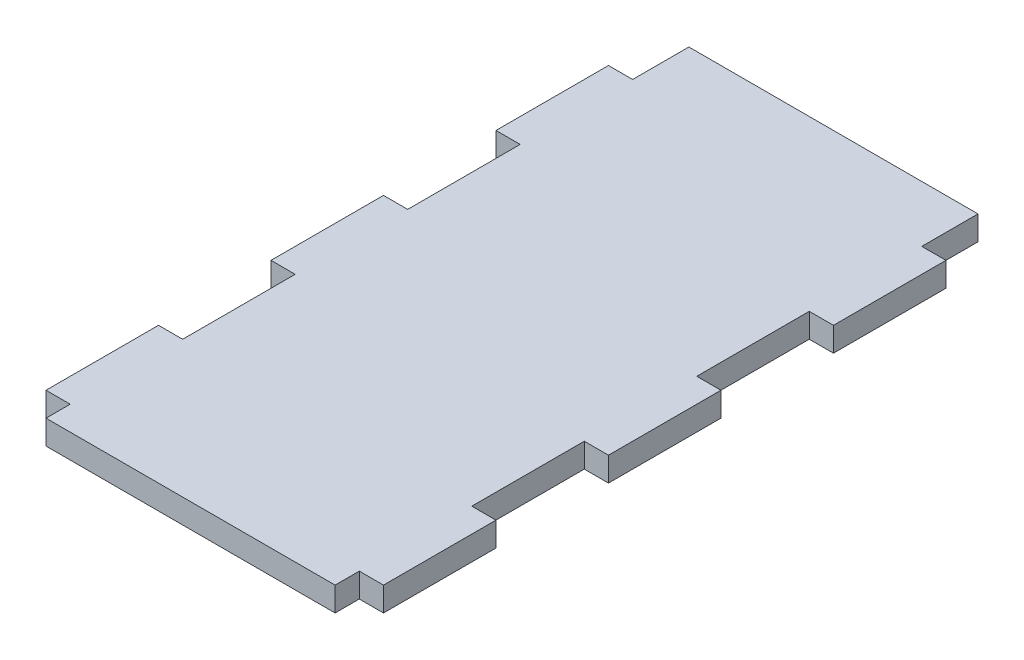
ISO-10303-21;
HEADER;
FILE_DESCRIPTION(('STEP AP214'),'2;1');
FILE_NAME('part.step','',(''),(''),'','','');
FILE_SCHEMA(('AUTOMOTIVE_DESIGN { 1 0 10303 214 1 1 1 1 }'));
ENDSEC;
DATA;
#1=APPLICATION_CONTEXT('core data for automotive mechanical design processes');
#2=APPLICATION_PROTOCOL_DEFINITION('international standard','automotive_design',2000,#1);
#3=PRODUCT_CONTEXT('',#1,'mechanical');
#4=PRODUCT('Part','Part','',(#3));
#5=PRODUCT_RELATED_PRODUCT_CATEGORY('part','',(#4));
#6=PRODUCT_DEFINITION_FORMATION('','',#4);
#7=PRODUCT_DEFINITION_CONTEXT('part definition',#1,'design');
#8=PRODUCT_DEFINITION('design','',#6,#7);
#9=PRODUCT_DEFINITION_SHAPE('','',#8);
#10=(LENGTH_UNIT() NAMED_UNIT(*) SI_UNIT(.MILLI.,.METRE.));
#11=(NAMED_UNIT(*) PLANE_ANGLE_UNIT() SI_UNIT($,.RADIAN.));
#12=(NAMED_UNIT(*) SI_UNIT($,.STERADIAN.) SOLID_ANGLE_UNIT());
#13=UNCERTAINTY_MEASURE_WITH_UNIT(LENGTH_MEASURE(1.E-05),#10,'distance_accuracy_value','');
#14=(GEOMETRIC_REPRESENTATION_CONTEXT(3) GLOBAL_UNCERTAINTY_ASSIGNED_CONTEXT((#13)) GLOBAL_UNIT_ASSIGNED_CONTEXT((#10,
#11,#12)) REPRESENTATION_CONTEXT('',''));
#15=CARTESIAN_POINT('',(0.,0.,0.));
#16=DIRECTION('',(0.,0.,1.));
#17=DIRECTION('',(1.,0.,0.));
#18=AXIS2_PLACEMENT_3D('',#15,#16,#17);
#19=CARTESIAN_POINT('',(38.1,5.461,-63.5));
#20=DIRECTION('',(0.,0.,1.));
#21=DIRECTION('',(1.,0.,0.));
#22=AXIS2_PLACEMENT_3D('',#19,#20,#21);
#23=PLANE('',#22);
#24=DIRECTION('',(0.,-1.,0.));
#25=VECTOR('',#24,1.);
#26=CARTESIAN_POINT('',(32.639,5.461,-63.5));
#27=LINE('',#26,#25);
#28=CARTESIAN_POINT('',(32.639,5.461,-63.5));
#29=VERTEX_POINT('',#28);
#30=CARTESIAN_POINT('',(32.639,0.,-63.5));
#31=VERTEX_POINT('',#30);
#32=EDGE_CURVE('E245',#29,#31,#27,.T.);
#33=ORIENTED_EDGE('',*,*,#32,.F.);
#34=DIRECTION('',(-1.,0.,0.));
#35=VECTOR('',#34,1.);
#36=CARTESIAN_POINT('',(38.1,5.461,-63.5));
#37=LINE('',#36,#35);
#38=CARTESIAN_POINT('',(38.1,5.461,-63.5));
#39=VERTEX_POINT('',#38);
#40=EDGE_CURVE('E389',#39,#29,#37,.T.);
#41=ORIENTED_EDGE('',*,*,#40,.F.);
#42=DIRECTION('',(0.,-1.,0.));
#43=VECTOR('',#42,1.);
#44=CARTESIAN_POINT('',(38.1,5.461,-63.5));
#45=LINE('',#44,#43);
#46=CARTESIAN_POINT('',(38.1,0.,-63.5));
#47=VERTEX_POINT('',#46);
#48=EDGE_CURVE('E410',#39,#47,#45,.T.);
#49=ORIENTED_EDGE('',*,*,#48,.T.);
#50=DIRECTION('',(-1.,0.,0.));
#51=VECTOR('',#50,1.);
#52=CARTESIAN_POINT('',(38.1,0.,-63.5));
#53=LINE('',#52,#51);
#54=EDGE_CURVE('E60',#47,#31,#53,.T.);
#55=ORIENTED_EDGE('',*,*,#54,.T.);
#56=EDGE_LOOP('',(#33,#41,#49,#55));
#57=FACE_BOUND('',#56,.T.);
#58=ADVANCED_FACE('F37',(#57),#23,.F.);
#59=DIRECTION('',(0.,1.,0.));
#60=VECTOR('',#59,1.);
#61=CARTESIAN_POINT('',(-32.639,5.46100000000001,-63.5));
#62=LINE('',#61,#60);
#63=CARTESIAN_POINT('',(-32.639,0.,-63.5));
#64=VERTEX_POINT('',#63);
#65=CARTESIAN_POINT('',(-32.639,5.46100000000001,-63.5));
#66=VERTEX_POINT('',#65);
#67=EDGE_CURVE('E52',#64,#66,#62,.T.);
#68=ORIENTED_EDGE('',*,*,#67,.F.);
#69=CARTESIAN_POINT('',(-38.1,0.,-63.5));
#70=VERTEX_POINT('',#69);
#71=EDGE_CURVE('E405',#64,#70,#53,.T.);
#72=ORIENTED_EDGE('',*,*,#71,.T.);
#73=DIRECTION('',(0.,-1.,0.));
#74=VECTOR('',#73,1.);
#75=CARTESIAN_POINT('',(-38.1,5.461,-63.5));
#76=LINE('',#75,#74);
#77=CARTESIAN_POINT('',(-38.1,5.461,-63.5));
#78=VERTEX_POINT('',#77);
#79=EDGE_CURVE('E392',#78,#70,#76,.T.);
#80=ORIENTED_EDGE('',*,*,#79,.F.);
#81=EDGE_CURVE('E387',#66,#78,#37,.T.);
#82=ORIENTED_EDGE('',*,*,#81,.F.);
#83=EDGE_LOOP('',(#68,#72,#80,#82));
#84=FACE_BOUND('',#83,.T.);
#85=ADVANCED_FACE('F489',(#84),#23,.F.);
#86=CARTESIAN_POINT('',(38.1,5.461,63.5));
#87=DIRECTION('',(0.,0.,-1.));
#88=DIRECTION('',(-1.,0.,0.));
#89=AXIS2_PLACEMENT_3D('',#86,#87,#88);
#90=PLANE('',#89);
#91=DIRECTION('',(0.,-1.,0.));
#92=VECTOR('',#91,1.);
#93=CARTESIAN_POINT('',(-32.639,5.461,63.5));
#94=LINE('',#93,#92);
#95=CARTESIAN_POINT('',(-32.639,5.461,63.5));
#96=VERTEX_POINT('',#95);
#97=CARTESIAN_POINT('',(-32.639,0.,63.5));
#98=VERTEX_POINT('',#97);
#99=EDGE_CURVE('E246',#96,#98,#94,.T.);
#100=ORIENTED_EDGE('',*,*,#99,.F.);
#101=DIRECTION('',(1.,0.,0.));
#102=VECTOR('',#101,1.);
#103=CARTESIAN_POINT('',(38.1,5.461,63.5));
#104=LINE('',#103,#102);
#105=CARTESIAN_POINT('',(-38.1,5.461,63.5));
#106=VERTEX_POINT('',#105);
#107=EDGE_CURVE('E380',#106,#96,#104,.T.);
#108=ORIENTED_EDGE('',*,*,#107,.F.);
#109=DIRECTION('',(0.,-1.,0.));
#110=VECTOR('',#109,1.);
#111=CARTESIAN_POINT('',(-38.1,5.461,63.5));
#112=LINE('',#111,#110);
#113=CARTESIAN_POINT('',(-38.1,0.,63.5));
#114=VERTEX_POINT('',#113);
#115=EDGE_CURVE('E11',#106,#114,#112,.T.);
#116=ORIENTED_EDGE('',*,*,#115,.T.);
#117=DIRECTION('',(1.,0.,0.));
#118=VECTOR('',#117,1.);
#119=CARTESIAN_POINT('',(38.1,0.,63.5));
#120=LINE('',#119,#118);
#121=EDGE_CURVE('E399',#114,#98,#120,.T.);
#122=ORIENTED_EDGE('',*,*,#121,.T.);
#123=EDGE_LOOP('',(#100,#108,#116,#122));
#124=FACE_BOUND('',#123,.T.);
#125=ADVANCED_FACE('F452',(#124),#90,.F.);
#126=DIRECTION('',(0.,1.,0.));
#127=VECTOR('',#126,1.);
#128=CARTESIAN_POINT('',(32.639,5.46100000000001,63.5));
#129=LINE('',#128,#127);
#130=CARTESIAN_POINT('',(32.639,0.,63.5));
#131=VERTEX_POINT('',#130);
#132=CARTESIAN_POINT('',(32.639,5.46100000000001,63.5));
#133=VERTEX_POINT('',#132);
#134=EDGE_CURVE('E249',#131,#133,#129,.T.);
#135=ORIENTED_EDGE('',*,*,#134,.F.);
#136=CARTESIAN_POINT('',(38.1,0.,63.5));
#137=VERTEX_POINT('',#136);
#138=EDGE_CURVE('E396',#131,#137,#120,.T.);
#139=ORIENTED_EDGE('',*,*,#138,.T.);
#140=DIRECTION('',(0.,-1.,0.));
#141=VECTOR('',#140,1.);
#142=CARTESIAN_POINT('',(38.1,5.461,63.5));
#143=LINE('',#142,#141);
#144=CARTESIAN_POINT('',(38.1,5.461,63.5));
#145=VERTEX_POINT('',#144);
#146=EDGE_CURVE('E45',#145,#137,#143,.T.);
#147=ORIENTED_EDGE('',*,*,#146,.F.);
#148=EDGE_CURVE('E377',#133,#145,#104,.T.);
#149=ORIENTED_EDGE('',*,*,#148,.F.);
#150=EDGE_LOOP('',(#135,#139,#147,#149));
#151=FACE_BOUND('',#150,.T.);
#152=ADVANCED_FACE('F438',(#151),#90,.F.);
#153=CARTESIAN_POINT('',(-38.1,5.461,63.5));
#154=DIRECTION('',(1.,0.,0.));
#155=DIRECTION('',(0.,0.,-1.));
#156=AXIS2_PLACEMENT_3D('',#153,#154,#155);
#157=PLANE('',#156);
#158=DIRECTION('',(0.,0.,1.));
#159=VECTOR('',#158,1.);
#160=CARTESIAN_POINT('',(-38.1,0.,63.5));
#161=LINE('',#160,#159);
#162=CARTESIAN_POINT('',(-38.100000000001,0.,-38.0999999999997));
#163=VERTEX_POINT('',#162);
#164=EDGE_CURVE('E393',#70,#163,#161,.T.);
#165=ORIENTED_EDGE('',*,*,#164,.T.);
#166=DIRECTION('',(0.,1.,0.));
#167=VECTOR('',#166,1.);
#168=CARTESIAN_POINT('',(-38.100000000001,0.,-38.0999999999997));
#169=LINE('',#168,#167);
#170=CARTESIAN_POINT('',(-38.100000000001,5.46099999999997,-38.0999999999998));
#171=VERTEX_POINT('',#170);
#172=EDGE_CURVE('E295',#163,#171,#169,.T.);
#173=ORIENTED_EDGE('',*,*,#172,.T.);
#174=DIRECTION('',(0.,0.,1.));
#175=VECTOR('',#174,1.);
#176=CARTESIAN_POINT('',(-38.1,5.461,63.5));
#177=LINE('',#176,#175);
#178=EDGE_CURVE('E374',#78,#171,#177,.T.);
#179=ORIENTED_EDGE('',*,*,#178,.F.);
#180=ORIENTED_EDGE('',*,*,#79,.T.);
#181=EDGE_LOOP('',(#165,#173,#179,#180));
#182=FACE_BOUND('',#181,.T.);
#183=ADVANCED_FACE('F486',(#182),#157,.F.);
#184=CARTESIAN_POINT('',(-38.1000000000009,5.46099999999996,-12.6999999999998));
#185=VERTEX_POINT('',#184);
#186=CARTESIAN_POINT('',(-38.1000000000008,5.46099999999996,12.7000000000002));
#187=VERTEX_POINT('',#186);
#188=EDGE_CURVE('E378',#185,#187,#177,.T.);
#189=ORIENTED_EDGE('',*,*,#188,.F.);
#190=DIRECTION('',(0.,-1.,0.));
#191=VECTOR('',#190,1.);
#192=CARTESIAN_POINT('',(-38.1000000000009,0.,-12.6999999999997));
#193=LINE('',#192,#191);
#194=CARTESIAN_POINT('',(-38.1000000000009,0.,-12.6999999999997));
#195=VERTEX_POINT('',#194);
#196=EDGE_CURVE('E283',#185,#195,#193,.T.);
#197=ORIENTED_EDGE('',*,*,#196,.T.);
#198=CARTESIAN_POINT('',(-38.1000000000008,0.,12.7000000000002));
#199=VERTEX_POINT('',#198);
#200=EDGE_CURVE('E397',#195,#199,#161,.T.);
#201=ORIENTED_EDGE('',*,*,#200,.T.);
#202=DIRECTION('',(0.,1.,0.));
#203=VECTOR('',#202,1.);
#204=CARTESIAN_POINT('',(-38.1000000000008,0.,12.7000000000002));
#205=LINE('',#204,#203);
#206=EDGE_CURVE('E286',#199,#187,#205,.T.);
#207=ORIENTED_EDGE('',*,*,#206,.T.);
#208=EDGE_LOOP('',(#189,#197,#201,#207));
#209=FACE_BOUND('',#208,.T.);
#210=ADVANCED_FACE('F462',(#209),#157,.F.);
#211=CARTESIAN_POINT('',(38.1,5.461,63.5));
#212=DIRECTION('',(-1.,0.,0.));
#213=DIRECTION('',(0.,0.,1.));
#214=AXIS2_PLACEMENT_3D('',#211,#212,#213);
#215=PLANE('',#214);
#216=DIRECTION('',(0.,-1.,0.));
#217=VECTOR('',#216,1.);
#218=CARTESIAN_POINT('',(38.0999999999997,1.66533453693773E-13,38.1));
#219=LINE('',#218,#217);
#220=CARTESIAN_POINT('',(38.0999999999996,5.46100000000015,38.1));
#221=VERTEX_POINT('',#220);
#222=CARTESIAN_POINT('',(38.0999999999997,1.66533453693773E-13,38.1));
#223=VERTEX_POINT('',#222);
#224=EDGE_CURVE('E357',#221,#223,#219,.T.);
#225=ORIENTED_EDGE('',*,*,#224,.F.);
#226=DIRECTION('',(0.,0.,-1.));
#227=VECTOR('',#226,1.);
#228=CARTESIAN_POINT('',(38.1,5.461,63.5));
#229=LINE('',#228,#227);
#230=EDGE_CURVE('E384',#145,#221,#229,.T.);
#231=ORIENTED_EDGE('',*,*,#230,.F.);
#232=ORIENTED_EDGE('',*,*,#146,.T.);
#233=DIRECTION('',(0.,0.,-1.));
#234=VECTOR('',#233,1.);
#235=CARTESIAN_POINT('',(38.1,0.,63.5));
#236=LINE('',#235,#234);
#237=EDGE_CURVE('E402',#137,#223,#236,.T.);
#238=ORIENTED_EDGE('',*,*,#237,.T.);
#239=EDGE_LOOP('',(#225,#231,#232,#238));
#240=FACE_BOUND('',#239,.T.);
#241=ADVANCED_FACE('F417',(#240),#215,.F.);
#242=DIRECTION('',(0.,1.,0.));
#243=VECTOR('',#242,1.);
#244=CARTESIAN_POINT('',(38.0999999999997,1.80411241501588E-13,12.7));
#245=LINE('',#244,#243);
#246=CARTESIAN_POINT('',(38.0999999999997,1.80411241501588E-13,12.7));
#247=VERTEX_POINT('',#246);
#248=CARTESIAN_POINT('',(38.0999999999996,5.46100000000014,12.7));
#249=VERTEX_POINT('',#248);
#250=EDGE_CURVE('E325',#247,#249,#245,.T.);
#251=ORIENTED_EDGE('',*,*,#250,.F.);
#252=CARTESIAN_POINT('',(38.0999999999997,2.08166817117217E-13,-12.6999999999999));
#253=VERTEX_POINT('',#252);
#254=EDGE_CURVE('E406',#247,#253,#236,.T.);
#255=ORIENTED_EDGE('',*,*,#254,.T.);
#256=DIRECTION('',(0.,-1.,0.));
#257=VECTOR('',#256,1.);
#258=CARTESIAN_POINT('',(38.0999999999997,2.08166817117217E-13,-12.6999999999999));
#259=LINE('',#258,#257);
#260=CARTESIAN_POINT('',(38.0999999999996,5.46100000000014,-12.6999999999999));
#261=VERTEX_POINT('',#260);
#262=EDGE_CURVE('E327',#261,#253,#259,.T.);
#263=ORIENTED_EDGE('',*,*,#262,.F.);
#264=EDGE_CURVE('E388',#249,#261,#229,.T.);
#265=ORIENTED_EDGE('',*,*,#264,.F.);
#266=EDGE_LOOP('',(#251,#255,#263,#265));
#267=FACE_BOUND('',#266,.T.);
#268=ADVANCED_FACE('F513',(#267),#215,.F.);
#269=DIRECTION('',(0.,1.,0.));
#270=VECTOR('',#269,1.);
#271=CARTESIAN_POINT('',(38.0999999999997,2.15105711021124E-13,-38.0999999999999));
#272=LINE('',#271,#270);
#273=CARTESIAN_POINT('',(38.0999999999997,2.15105711021124E-13,-38.0999999999999));
#274=VERTEX_POINT('',#273);
#275=CARTESIAN_POINT('',(38.0999999999996,5.46100000000015,-38.1));
#276=VERTEX_POINT('',#275);
#277=EDGE_CURVE('E347',#274,#276,#272,.T.);
#278=ORIENTED_EDGE('',*,*,#277,.F.);
#279=EDGE_CURVE('E401',#274,#47,#236,.T.);
#280=ORIENTED_EDGE('',*,*,#279,.T.);
#281=ORIENTED_EDGE('',*,*,#48,.F.);
#282=EDGE_CURVE('E383',#276,#39,#229,.T.);
#283=ORIENTED_EDGE('',*,*,#282,.F.);
#284=EDGE_LOOP('',(#278,#280,#281,#283));
#285=FACE_BOUND('',#284,.T.);
#286=ADVANCED_FACE('F522',(#285),#215,.F.);
#287=CARTESIAN_POINT('',(0.,0.,0.));
#288=DIRECTION('',(0.,1.,0.));
#289=DIRECTION('',(0.,0.,1.));
#290=AXIS2_PLACEMENT_3D('',#287,#288,#289);
#291=PLANE('',#290);
#292=DIRECTION('',(0.,0.,-1.));
#293=VECTOR('',#292,1.);
#294=CARTESIAN_POINT('',(-32.6390000000004,0.,82.9351920908021));
#295=LINE('',#294,#293);
#296=CARTESIAN_POINT('',(-32.6390000000009,0.,-12.6999999999998));
#297=VERTEX_POINT('',#296);
#298=CARTESIAN_POINT('',(-32.639000000001,0.,-38.0999999999998));
#299=VERTEX_POINT('',#298);
#300=EDGE_CURVE('E311',#297,#299,#295,.T.);
#301=ORIENTED_EDGE('',*,*,#300,.T.);
#302=DIRECTION('',(-1.,0.,0.));
#303=VECTOR('',#302,1.);
#304=CARTESIAN_POINT('',(-32.639000000001,0.,-38.0999999999998));
#305=LINE('',#304,#303);
#306=EDGE_CURVE('E308',#299,#163,#305,.T.);
#307=ORIENTED_EDGE('',*,*,#306,.T.);
#308=ORIENTED_EDGE('',*,*,#164,.F.);
#309=ORIENTED_EDGE('',*,*,#71,.F.);
#310=DIRECTION('',(0.,0.,1.));
#311=VECTOR('',#310,1.);
#312=CARTESIAN_POINT('',(-32.639,0.,-76.2));
#313=LINE('',#312,#311);
#314=CARTESIAN_POINT('',(-32.639,0.,-76.2));
#315=VERTEX_POINT('',#314);
#316=EDGE_CURVE('E230',#315,#64,#313,.T.);
#317=ORIENTED_EDGE('',*,*,#316,.F.);
#318=DIRECTION('',(-1.,0.,0.));
#319=VECTOR('',#318,1.);
#320=CARTESIAN_POINT('',(32.639,0.,-76.2));
#321=LINE('',#320,#319);
#322=CARTESIAN_POINT('',(32.639,0.,-76.2));
#323=VERTEX_POINT('',#322);
#324=EDGE_CURVE('E222',#323,#315,#321,.T.);
#325=ORIENTED_EDGE('',*,*,#324,.F.);
#326=DIRECTION('',(0.,0.,1.));
#327=VECTOR('',#326,1.);
#328=CARTESIAN_POINT('',(32.639,0.,-76.2));
#329=LINE('',#328,#327);
#330=EDGE_CURVE('E227',#323,#31,#329,.T.);
#331=ORIENTED_EDGE('',*,*,#330,.T.);
#332=ORIENTED_EDGE('',*,*,#54,.F.);
#333=ORIENTED_EDGE('',*,*,#279,.F.);
#334=DIRECTION('',(-1.,0.,0.));
#335=VECTOR('',#334,1.);
#336=CARTESIAN_POINT('',(38.0999999999997,2.15105711021124E-13,-38.0999999999999));
#337=LINE('',#336,#335);
#338=CARTESIAN_POINT('',(32.6389999999997,1.89084858881472E-13,-38.0999999999999));
#339=VERTEX_POINT('',#338);
#340=EDGE_CURVE('E352',#274,#339,#337,.T.);
#341=ORIENTED_EDGE('',*,*,#340,.T.);
#342=DIRECTION('',(0.,0.,-1.));
#343=VECTOR('',#342,1.);
#344=CARTESIAN_POINT('',(32.6389999999997,1.28369537222284E-13,82.9351920908019));
#345=LINE('',#344,#343);
#346=CARTESIAN_POINT('',(32.6389999999997,0.,-12.6999999999999));
#347=VERTEX_POINT('',#346);
#348=EDGE_CURVE('E355',#347,#339,#345,.T.);
#349=ORIENTED_EDGE('',*,*,#348,.F.);
#350=DIRECTION('',(-1.,0.,0.));
#351=VECTOR('',#350,1.);
#352=CARTESIAN_POINT('',(38.0999999999997,2.08166817117217E-13,-12.6999999999999));
#353=LINE('',#352,#351);
#354=EDGE_CURVE('E341',#253,#347,#353,.T.);
#355=ORIENTED_EDGE('',*,*,#354,.F.);
#356=ORIENTED_EDGE('',*,*,#254,.F.);
#357=DIRECTION('',(-1.,0.,0.));
#358=VECTOR('',#357,1.);
#359=CARTESIAN_POINT('',(38.0999999999997,1.80411241501588E-13,12.7));
#360=LINE('',#359,#358);
#361=CARTESIAN_POINT('',(32.6389999999997,1.54390389361936E-13,12.7));
#362=VERTEX_POINT('',#361);
#363=EDGE_CURVE('E337',#247,#362,#360,.T.);
#364=ORIENTED_EDGE('',*,*,#363,.T.);
#365=CARTESIAN_POINT('',(32.6389999999997,0.,38.1));
#366=VERTEX_POINT('',#365);
#367=EDGE_CURVE('E319',#366,#362,#345,.T.);
#368=ORIENTED_EDGE('',*,*,#367,.F.);
#369=DIRECTION('',(-1.,0.,0.));
#370=VECTOR('',#369,1.);
#371=CARTESIAN_POINT('',(38.0999999999997,1.66533453693773E-13,38.1));
#372=LINE('',#371,#370);
#373=EDGE_CURVE('E334',#223,#366,#372,.T.);
#374=ORIENTED_EDGE('',*,*,#373,.F.);
#375=ORIENTED_EDGE('',*,*,#237,.F.);
#376=ORIENTED_EDGE('',*,*,#138,.F.);
#377=DIRECTION('',(0.,0.,-1.));
#378=VECTOR('',#377,1.);
#379=CARTESIAN_POINT('',(32.639,0.,68.961));
#380=LINE('',#379,#378);
#381=CARTESIAN_POINT('',(32.639,0.,68.961));
#382=VERTEX_POINT('',#381);
#383=EDGE_CURVE('E272',#382,#131,#380,.T.);
#384=ORIENTED_EDGE('',*,*,#383,.F.);
#385=DIRECTION('',(1.,0.,0.));
#386=VECTOR('',#385,1.);
#387=CARTESIAN_POINT('',(-32.639,0.,68.961));
#388=LINE('',#387,#386);
#389=CARTESIAN_POINT('',(-32.639,0.,68.961));
#390=VERTEX_POINT('',#389);
#391=EDGE_CURVE('E258',#390,#382,#388,.T.);
#392=ORIENTED_EDGE('',*,*,#391,.F.);
#393=DIRECTION('',(0.,0.,-1.));
#394=VECTOR('',#393,1.);
#395=CARTESIAN_POINT('',(-32.639,0.,68.961));
#396=LINE('',#395,#394);
#397=EDGE_CURVE('E275',#390,#98,#396,.T.);
#398=ORIENTED_EDGE('',*,*,#397,.T.);
#399=ORIENTED_EDGE('',*,*,#121,.F.);
#400=CARTESIAN_POINT('',(-38.1000000000006,0.,38.1000000000002));
#401=VERTEX_POINT('',#400);
#402=EDGE_CURVE('E398',#401,#114,#161,.T.);
#403=ORIENTED_EDGE('',*,*,#402,.F.);
#404=DIRECTION('',(-1.,0.,0.));
#405=VECTOR('',#404,1.);
#406=CARTESIAN_POINT('',(-32.6390000000006,0.,38.1000000000002));
#407=LINE('',#406,#405);
#408=CARTESIAN_POINT('',(-32.6390000000006,0.,38.1000000000002));
#409=VERTEX_POINT('',#408);
#410=EDGE_CURVE('E289',#409,#401,#407,.T.);
#411=ORIENTED_EDGE('',*,*,#410,.F.);
#412=CARTESIAN_POINT('',(-32.6390000000008,0.,12.7000000000002));
#413=VERTEX_POINT('',#412);
#414=EDGE_CURVE('E324',#409,#413,#295,.T.);
#415=ORIENTED_EDGE('',*,*,#414,.T.);
#416=DIRECTION('',(-1.,0.,0.));
#417=VECTOR('',#416,1.);
#418=CARTESIAN_POINT('',(-32.6390000000008,0.,12.7000000000002));
#419=LINE('',#418,#417);
#420=EDGE_CURVE('E292',#413,#199,#419,.T.);
#421=ORIENTED_EDGE('',*,*,#420,.T.);
#422=ORIENTED_EDGE('',*,*,#200,.F.);
#423=DIRECTION('',(-1.,0.,0.));
#424=VECTOR('',#423,1.);
#425=CARTESIAN_POINT('',(-32.6390000000009,0.,-12.6999999999998));
#426=LINE('',#425,#424);
#427=EDGE_CURVE('E296',#297,#195,#426,.T.);
#428=ORIENTED_EDGE('',*,*,#427,.F.);
#429=EDGE_LOOP('',(#301,#307,#308,#309,#317,#325,#331,#332,#333,#341,#349,#355,#356,#364,#368,
#374,#375,#376,#384,#392,#398,#399,#403,#411,#415,#421,#422,#428));
#430=FACE_BOUND('',#429,.T.);
#431=ADVANCED_FACE('F225',(#430),#291,.F.);
#432=CARTESIAN_POINT('',(-38.1000000000006,5.46099999999997,38.1000000000002));
#433=VERTEX_POINT('',#432);
#434=EDGE_CURVE('E379',#433,#106,#177,.T.);
#435=ORIENTED_EDGE('',*,*,#434,.F.);
#436=DIRECTION('',(0.,-1.,0.));
#437=VECTOR('',#436,1.);
#438=CARTESIAN_POINT('',(-38.1000000000006,0.,38.1000000000002));
#439=LINE('',#438,#437);
#440=EDGE_CURVE('E316',#433,#401,#439,.T.);
#441=ORIENTED_EDGE('',*,*,#440,.T.);
#442=ORIENTED_EDGE('',*,*,#402,.T.);
#443=ORIENTED_EDGE('',*,*,#115,.F.);
#444=EDGE_LOOP('',(#435,#441,#442,#443));
#445=FACE_BOUND('',#444,.T.);
#446=ADVANCED_FACE('F39',(#445),#157,.F.);
#447=CARTESIAN_POINT('',(0.,5.461,0.));
#448=DIRECTION('',(0.,1.,0.));
#449=DIRECTION('',(0.,0.,1.));
#450=AXIS2_PLACEMENT_3D('',#447,#448,#449);
#451=PLANE('',#450);
#452=DIRECTION('',(-1.,0.,0.));
#453=VECTOR('',#452,1.);
#454=CARTESIAN_POINT('',(-32.639000000001,5.46099999999997,-38.0999999999998));
#455=LINE('',#454,#453);
#456=CARTESIAN_POINT('',(-32.639000000001,5.46099999999997,-38.0999999999998));
#457=VERTEX_POINT('',#456);
#458=EDGE_CURVE('E305',#457,#171,#455,.T.);
#459=ORIENTED_EDGE('',*,*,#458,.F.);
#460=DIRECTION('',(0.,0.,1.));
#461=VECTOR('',#460,1.);
#462=CARTESIAN_POINT('',(-32.6390000000008,5.461,1.64696710789036E-13));
#463=LINE('',#462,#461);
#464=CARTESIAN_POINT('',(-32.6390000000009,5.46099999999996,-12.6999999999998));
#465=VERTEX_POINT('',#464);
#466=EDGE_CURVE('E373',#457,#465,#463,.T.);
#467=ORIENTED_EDGE('',*,*,#466,.T.);
#468=DIRECTION('',(-1.,0.,0.));
#469=VECTOR('',#468,1.);
#470=CARTESIAN_POINT('',(-32.6390000000009,5.46099999999996,-12.6999999999998));
#471=LINE('',#470,#469);
#472=EDGE_CURVE('E298',#465,#185,#471,.T.);
#473=ORIENTED_EDGE('',*,*,#472,.T.);
#474=ORIENTED_EDGE('',*,*,#188,.T.);
#475=DIRECTION('',(-1.,0.,0.));
#476=VECTOR('',#475,1.);
#477=CARTESIAN_POINT('',(-32.6390000000008,5.46099999999996,12.7000000000002));
#478=LINE('',#477,#476);
#479=CARTESIAN_POINT('',(-32.6390000000008,5.46099999999996,12.7000000000002));
#480=VERTEX_POINT('',#479);
#481=EDGE_CURVE('E285',#480,#187,#478,.T.);
#482=ORIENTED_EDGE('',*,*,#481,.F.);
#483=CARTESIAN_POINT('',(-32.6390000000006,5.46099999999997,38.1000000000002));
#484=VERTEX_POINT('',#483);
#485=EDGE_CURVE('E370',#480,#484,#463,.T.);
#486=ORIENTED_EDGE('',*,*,#485,.T.);
#487=DIRECTION('',(-1.,0.,0.));
#488=VECTOR('',#487,1.);
#489=CARTESIAN_POINT('',(-32.6390000000006,5.46099999999997,38.1000000000002));
#490=LINE('',#489,#488);
#491=EDGE_CURVE('E315',#484,#433,#490,.T.);
#492=ORIENTED_EDGE('',*,*,#491,.T.);
#493=ORIENTED_EDGE('',*,*,#434,.T.);
#494=ORIENTED_EDGE('',*,*,#107,.T.);
#495=DIRECTION('',(0.,0.,-1.));
#496=VECTOR('',#495,1.);
#497=CARTESIAN_POINT('',(-32.639,5.461,68.961));
#498=LINE('',#497,#496);
#499=CARTESIAN_POINT('',(-32.639,5.461,68.961));
#500=VERTEX_POINT('',#499);
#501=EDGE_CURVE('E263',#500,#96,#498,.T.);
#502=ORIENTED_EDGE('',*,*,#501,.F.);
#503=DIRECTION('',(-1.,0.,0.));
#504=VECTOR('',#503,1.);
#505=CARTESIAN_POINT('',(-32.639,5.461,68.961));
#506=LINE('',#505,#504);
#507=CARTESIAN_POINT('',(32.639,5.46100000000001,68.961));
#508=VERTEX_POINT('',#507);
#509=EDGE_CURVE('E262',#508,#500,#506,.T.);
#510=ORIENTED_EDGE('',*,*,#509,.F.);
#511=DIRECTION('',(0.,0.,-1.));
#512=VECTOR('',#511,1.);
#513=CARTESIAN_POINT('',(32.639,5.46100000000001,68.961));
#514=LINE('',#513,#512);
#515=EDGE_CURVE('E269',#508,#133,#514,.T.);
#516=ORIENTED_EDGE('',*,*,#515,.T.);
#517=ORIENTED_EDGE('',*,*,#148,.T.);
#518=ORIENTED_EDGE('',*,*,#230,.T.);
#519=DIRECTION('',(-1.,0.,0.));
#520=VECTOR('',#519,1.);
#521=CARTESIAN_POINT('',(38.0999999999996,5.46100000000015,38.1));
#522=LINE('',#521,#520);
#523=CARTESIAN_POINT('',(32.6389999999996,5.46100000000012,38.1));
#524=VERTEX_POINT('',#523);
#525=EDGE_CURVE('E359',#221,#524,#522,.T.);
#526=ORIENTED_EDGE('',*,*,#525,.T.);
#527=DIRECTION('',(0.,0.,1.));
#528=VECTOR('',#527,1.);
#529=CARTESIAN_POINT('',(32.6389999999996,5.461,0.));
#530=LINE('',#529,#528);
#531=CARTESIAN_POINT('',(32.6389999999996,5.46100000000011,12.7));
#532=VERTEX_POINT('',#531);
#533=EDGE_CURVE('E367',#532,#524,#530,.T.);
#534=ORIENTED_EDGE('',*,*,#533,.F.);
#535=DIRECTION('',(-1.,0.,0.));
#536=VECTOR('',#535,1.);
#537=CARTESIAN_POINT('',(38.0999999999996,5.46100000000014,12.7));
#538=LINE('',#537,#536);
#539=EDGE_CURVE('E330',#249,#532,#538,.T.);
#540=ORIENTED_EDGE('',*,*,#539,.F.);
#541=ORIENTED_EDGE('',*,*,#264,.T.);
#542=DIRECTION('',(-1.,0.,0.));
#543=VECTOR('',#542,1.);
#544=CARTESIAN_POINT('',(38.0999999999996,5.46100000000014,-12.6999999999999));
#545=LINE('',#544,#543);
#546=CARTESIAN_POINT('',(32.6389999999996,5.46100000000011,-12.6999999999999));
#547=VERTEX_POINT('',#546);
#548=EDGE_CURVE('E343',#261,#547,#545,.T.);
#549=ORIENTED_EDGE('',*,*,#548,.T.);
#550=CARTESIAN_POINT('',(32.6389999999996,5.46100000000012,-38.1));
#551=VERTEX_POINT('',#550);
#552=EDGE_CURVE('E369',#551,#547,#530,.T.);
#553=ORIENTED_EDGE('',*,*,#552,.F.);
#554=DIRECTION('',(-1.,0.,0.));
#555=VECTOR('',#554,1.);
#556=CARTESIAN_POINT('',(38.0999999999996,5.46100000000015,-38.1));
#557=LINE('',#556,#555);
#558=EDGE_CURVE('E349',#276,#551,#557,.T.);
#559=ORIENTED_EDGE('',*,*,#558,.F.);
#560=ORIENTED_EDGE('',*,*,#282,.T.);
#561=ORIENTED_EDGE('',*,*,#40,.T.);
#562=DIRECTION('',(0.,0.,1.));
#563=VECTOR('',#562,1.);
#564=CARTESIAN_POINT('',(32.639,5.461,-76.2));
#565=LINE('',#564,#563);
#566=CARTESIAN_POINT('',(32.639,5.461,-76.2));
#567=VERTEX_POINT('',#566);
#568=EDGE_CURVE('E495',#567,#29,#565,.T.);
#569=ORIENTED_EDGE('',*,*,#568,.F.);
#570=DIRECTION('',(1.,0.,0.));
#571=VECTOR('',#570,1.);
#572=CARTESIAN_POINT('',(32.639,5.461,-76.2));
#573=LINE('',#572,#571);
#574=CARTESIAN_POINT('',(-32.639,5.46100000000001,-76.2));
#575=VERTEX_POINT('',#574);
#576=EDGE_CURVE('E239',#575,#567,#573,.T.);
#577=ORIENTED_EDGE('',*,*,#576,.F.);
#578=DIRECTION('',(0.,0.,1.));
#579=VECTOR('',#578,1.);
#580=CARTESIAN_POINT('',(-32.639,5.46100000000001,-76.2));
#581=LINE('',#580,#579);
#582=EDGE_CURVE('E251',#575,#66,#581,.T.);
#583=ORIENTED_EDGE('',*,*,#582,.T.);
#584=ORIENTED_EDGE('',*,*,#81,.T.);
#585=ORIENTED_EDGE('',*,*,#178,.T.);
#586=EDGE_LOOP('',(#459,#467,#473,#474,#482,#486,#492,#493,#494,#502,#510,#516,#517,#518,#526,
#534,#540,#541,#549,#553,#559,#560,#561,#569,#577,#583,#584,#585));
#587=FACE_BOUND('',#586,.T.);
#588=ADVANCED_FACE('F433',(#587),#451,.T.);
#589=CARTESIAN_POINT('',(32.6389999999996,6.73519209080199,82.9351920908019));
#590=DIRECTION('',(-1.,0.,0.));
#591=DIRECTION('',(0.,0.707106781186548,-0.707106781186548));
#592=AXIS2_PLACEMENT_3D('',#589,#590,#591);
#593=PLANE('',#592);
#594=ORIENTED_EDGE('',*,*,#533,.T.);
#595=DIRECTION('',(0.,-1.,0.));
#596=VECTOR('',#595,1.);
#597=CARTESIAN_POINT('',(32.6389999999997,1.40512601554121E-13,38.1));
#598=LINE('',#597,#596);
#599=EDGE_CURVE('E278',#524,#366,#598,.T.);
#600=ORIENTED_EDGE('',*,*,#599,.T.);
#601=ORIENTED_EDGE('',*,*,#367,.T.);
#602=DIRECTION('',(0.,1.,0.));
#603=VECTOR('',#602,1.);
#604=CARTESIAN_POINT('',(32.6389999999997,1.54390389361936E-13,12.7));
#605=LINE('',#604,#603);
#606=EDGE_CURVE('E331',#362,#532,#605,.T.);
#607=ORIENTED_EDGE('',*,*,#606,.T.);
#608=EDGE_LOOP('',(#594,#600,#601,#607));
#609=FACE_BOUND('',#608,.T.);
#610=ADVANCED_FACE('F428',(#609),#593,.F.);
#611=CARTESIAN_POINT('',(38.0999999999997,1.80411241501588E-13,12.7));
#612=DIRECTION('',(0.,0.,1.));
#613=DIRECTION('',(0.,1.,0.));
#614=AXIS2_PLACEMENT_3D('',#611,#612,#613);
#615=PLANE('',#614);
#616=ORIENTED_EDGE('',*,*,#606,.F.);
#617=ORIENTED_EDGE('',*,*,#363,.F.);
#618=ORIENTED_EDGE('',*,*,#250,.T.);
#619=ORIENTED_EDGE('',*,*,#539,.T.);
#620=EDGE_LOOP('',(#616,#617,#618,#619));
#621=FACE_BOUND('',#620,.T.);
#622=ADVANCED_FACE('F594',(#621),#615,.T.);
#623=CARTESIAN_POINT('',(38.0999999999997,1.66533453693773E-13,38.1));
#624=DIRECTION('',(0.,0.,-1.));
#625=DIRECTION('',(0.,-1.,0.));
#626=AXIS2_PLACEMENT_3D('',#623,#624,#625);
#627=PLANE('',#626);
#628=ORIENTED_EDGE('',*,*,#599,.F.);
#629=ORIENTED_EDGE('',*,*,#525,.F.);
#630=ORIENTED_EDGE('',*,*,#224,.T.);
#631=ORIENTED_EDGE('',*,*,#373,.T.);
#632=EDGE_LOOP('',(#628,#629,#630,#631));
#633=FACE_BOUND('',#632,.T.);
#634=ADVANCED_FACE('F426',(#633),#627,.T.);
#635=ORIENTED_EDGE('',*,*,#552,.T.);
#636=DIRECTION('',(0.,-1.,0.));
#637=VECTOR('',#636,1.);
#638=CARTESIAN_POINT('',(32.6389999999997,1.82145964977565E-13,-12.6999999999999));
#639=LINE('',#638,#637);
#640=EDGE_CURVE('E328',#547,#347,#639,.T.);
#641=ORIENTED_EDGE('',*,*,#640,.T.);
#642=ORIENTED_EDGE('',*,*,#348,.T.);
#643=DIRECTION('',(0.,1.,0.));
#644=VECTOR('',#643,1.);
#645=CARTESIAN_POINT('',(32.6389999999997,1.89084858881472E-13,-38.0999999999999));
#646=LINE('',#645,#644);
#647=EDGE_CURVE('E340',#339,#551,#646,.T.);
#648=ORIENTED_EDGE('',*,*,#647,.T.);
#649=EDGE_LOOP('',(#635,#641,#642,#648));
#650=FACE_BOUND('',#649,.T.);
#651=ADVANCED_FACE('F519',(#650),#593,.F.);
#652=CARTESIAN_POINT('',(38.0999999999997,2.08166817117217E-13,-12.6999999999999));
#653=DIRECTION('',(0.,0.,-1.));
#654=DIRECTION('',(0.,-1.,0.));
#655=AXIS2_PLACEMENT_3D('',#652,#653,#654);
#656=PLANE('',#655);
#657=ORIENTED_EDGE('',*,*,#640,.F.);
#658=ORIENTED_EDGE('',*,*,#548,.F.);
#659=ORIENTED_EDGE('',*,*,#262,.T.);
#660=ORIENTED_EDGE('',*,*,#354,.T.);
#661=EDGE_LOOP('',(#657,#658,#659,#660));
#662=FACE_BOUND('',#661,.T.);
#663=ADVANCED_FACE('F517',(#662),#656,.T.);
#664=CARTESIAN_POINT('',(38.0999999999997,2.15105711021124E-13,-38.0999999999999));
#665=DIRECTION('',(0.,0.,1.));
#666=DIRECTION('',(0.,1.,0.));
#667=AXIS2_PLACEMENT_3D('',#664,#665,#666);
#668=PLANE('',#667);
#669=ORIENTED_EDGE('',*,*,#647,.F.);
#670=ORIENTED_EDGE('',*,*,#340,.F.);
#671=ORIENTED_EDGE('',*,*,#277,.T.);
#672=ORIENTED_EDGE('',*,*,#558,.T.);
#673=EDGE_LOOP('',(#669,#670,#671,#672));
#674=FACE_BOUND('',#673,.T.);
#675=ADVANCED_FACE('F523',(#674),#668,.T.);
#676=CARTESIAN_POINT('',(-32.6390000000004,6.73519209080184,82.9351920908021));
#677=DIRECTION('',(-1.,0.,0.));
#678=DIRECTION('',(0.,0.707106781186548,-0.707106781186548));
#679=AXIS2_PLACEMENT_3D('',#676,#677,#678);
#680=PLANE('',#679);
#681=DIRECTION('',(0.,1.,0.));
#682=VECTOR('',#681,1.);
#683=CARTESIAN_POINT('',(-32.6390000000008,0.,12.7000000000002));
#684=LINE('',#683,#682);
#685=EDGE_CURVE('E279',#413,#480,#684,.T.);
#686=ORIENTED_EDGE('',*,*,#685,.F.);
#687=ORIENTED_EDGE('',*,*,#414,.F.);
#688=DIRECTION('',(0.,-1.,0.));
#689=VECTOR('',#688,1.);
#690=CARTESIAN_POINT('',(-32.6390000000006,0.,38.1000000000002));
#691=LINE('',#690,#689);
#692=EDGE_CURVE('E313',#484,#409,#691,.T.);
#693=ORIENTED_EDGE('',*,*,#692,.F.);
#694=ORIENTED_EDGE('',*,*,#485,.F.);
#695=EDGE_LOOP('',(#686,#687,#693,#694));
#696=FACE_BOUND('',#695,.T.);
#697=ADVANCED_FACE('F475',(#696),#680,.T.);
#698=CARTESIAN_POINT('',(-32.6390000000008,0.,12.7000000000002));
#699=DIRECTION('',(0.,0.,1.));
#700=DIRECTION('',(0.,1.,0.));
#701=AXIS2_PLACEMENT_3D('',#698,#699,#700);
#702=PLANE('',#701);
#703=ORIENTED_EDGE('',*,*,#206,.F.);
#704=ORIENTED_EDGE('',*,*,#420,.F.);
#705=ORIENTED_EDGE('',*,*,#685,.T.);
#706=ORIENTED_EDGE('',*,*,#481,.T.);
#707=EDGE_LOOP('',(#703,#704,#705,#706));
#708=FACE_BOUND('',#707,.T.);
#709=ADVANCED_FACE('F466',(#708),#702,.T.);
#710=CARTESIAN_POINT('',(-32.6390000000006,0.,38.1000000000002));
#711=DIRECTION('',(0.,0.,-1.));
#712=DIRECTION('',(0.,-1.,0.));
#713=AXIS2_PLACEMENT_3D('',#710,#711,#712);
#714=PLANE('',#713);
#715=ORIENTED_EDGE('',*,*,#440,.F.);
#716=ORIENTED_EDGE('',*,*,#491,.F.);
#717=ORIENTED_EDGE('',*,*,#692,.T.);
#718=ORIENTED_EDGE('',*,*,#410,.T.);
#719=EDGE_LOOP('',(#715,#716,#717,#718));
#720=FACE_BOUND('',#719,.T.);
#721=ADVANCED_FACE('F477',(#720),#714,.T.);
#722=DIRECTION('',(0.,1.,0.));
#723=VECTOR('',#722,1.);
#724=CARTESIAN_POINT('',(-32.639000000001,0.,-38.0999999999998));
#725=LINE('',#724,#723);
#726=EDGE_CURVE('E302',#299,#457,#725,.T.);
#727=ORIENTED_EDGE('',*,*,#726,.F.);
#728=ORIENTED_EDGE('',*,*,#300,.F.);
#729=DIRECTION('',(0.,-1.,0.));
#730=VECTOR('',#729,1.);
#731=CARTESIAN_POINT('',(-32.6390000000009,0.,-12.6999999999998));
#732=LINE('',#731,#730);
#733=EDGE_CURVE('E282',#465,#297,#732,.T.);
#734=ORIENTED_EDGE('',*,*,#733,.F.);
#735=ORIENTED_EDGE('',*,*,#466,.F.);
#736=EDGE_LOOP('',(#727,#728,#734,#735));
#737=FACE_BOUND('',#736,.T.);
#738=ADVANCED_FACE('F480',(#737),#680,.T.);
#739=CARTESIAN_POINT('',(-32.6390000000009,0.,-12.6999999999998));
#740=DIRECTION('',(0.,0.,-1.));
#741=DIRECTION('',(0.,-1.,0.));
#742=AXIS2_PLACEMENT_3D('',#739,#740,#741);
#743=PLANE('',#742);
#744=ORIENTED_EDGE('',*,*,#196,.F.);
#745=ORIENTED_EDGE('',*,*,#472,.F.);
#746=ORIENTED_EDGE('',*,*,#733,.T.);
#747=ORIENTED_EDGE('',*,*,#427,.T.);
#748=EDGE_LOOP('',(#744,#745,#746,#747));
#749=FACE_BOUND('',#748,.T.);
#750=ADVANCED_FACE('F679',(#749),#743,.T.);
#751=CARTESIAN_POINT('',(-32.639000000001,0.,-38.0999999999998));
#752=DIRECTION('',(0.,0.,1.));
#753=DIRECTION('',(0.,1.,0.));
#754=AXIS2_PLACEMENT_3D('',#751,#752,#753);
#755=PLANE('',#754);
#756=ORIENTED_EDGE('',*,*,#172,.F.);
#757=ORIENTED_EDGE('',*,*,#306,.F.);
#758=ORIENTED_EDGE('',*,*,#726,.T.);
#759=ORIENTED_EDGE('',*,*,#458,.T.);
#760=EDGE_LOOP('',(#756,#757,#758,#759));
#761=FACE_BOUND('',#760,.T.);
#762=ADVANCED_FACE('F483',(#761),#755,.T.);
#763=CARTESIAN_POINT('',(-32.639,5.461,68.961));
#764=DIRECTION('',(1.,0.,0.));
#765=DIRECTION('',(0.,0.,-1.));
#766=AXIS2_PLACEMENT_3D('',#763,#764,#765);
#767=PLANE('',#766);
#768=ORIENTED_EDGE('',*,*,#99,.T.);
#769=ORIENTED_EDGE('',*,*,#397,.F.);
#770=DIRECTION('',(0.,-1.,0.));
#771=VECTOR('',#770,1.);
#772=CARTESIAN_POINT('',(-32.639,5.461,68.961));
#773=LINE('',#772,#771);
#774=EDGE_CURVE('E255',#500,#390,#773,.T.);
#775=ORIENTED_EDGE('',*,*,#774,.F.);
#776=ORIENTED_EDGE('',*,*,#501,.T.);
#777=EDGE_LOOP('',(#768,#769,#775,#776));
#778=FACE_BOUND('',#777,.T.);
#779=ADVANCED_FACE('F449',(#778),#767,.F.);
#780=CARTESIAN_POINT('',(32.639,5.46100000000001,68.961));
#781=DIRECTION('',(-1.,0.,0.));
#782=DIRECTION('',(0.,0.,1.));
#783=AXIS2_PLACEMENT_3D('',#780,#781,#782);
#784=PLANE('',#783);
#785=ORIENTED_EDGE('',*,*,#134,.T.);
#786=ORIENTED_EDGE('',*,*,#515,.F.);
#787=DIRECTION('',(0.,1.,0.));
#788=VECTOR('',#787,1.);
#789=CARTESIAN_POINT('',(32.639,5.46100000000001,68.961));
#790=LINE('',#789,#788);
#791=EDGE_CURVE('E260',#382,#508,#790,.T.);
#792=ORIENTED_EDGE('',*,*,#791,.F.);
#793=ORIENTED_EDGE('',*,*,#383,.T.);
#794=EDGE_LOOP('',(#785,#786,#792,#793));
#795=FACE_BOUND('',#794,.T.);
#796=ADVANCED_FACE('F440',(#795),#784,.F.);
#797=CARTESIAN_POINT('',(0.,0.,68.961));
#798=DIRECTION('',(0.,0.,1.));
#799=DIRECTION('',(1.,0.,0.));
#800=AXIS2_PLACEMENT_3D('',#797,#798,#799);
#801=PLANE('',#800);
#802=ORIENTED_EDGE('',*,*,#774,.T.);
#803=ORIENTED_EDGE('',*,*,#391,.T.);
#804=ORIENTED_EDGE('',*,*,#791,.T.);
#805=ORIENTED_EDGE('',*,*,#509,.T.);
#806=EDGE_LOOP('',(#802,#803,#804,#805));
#807=FACE_BOUND('',#806,.T.);
#808=ADVANCED_FACE('F446',(#807),#801,.T.);
#809=CARTESIAN_POINT('',(32.639,5.461,-76.2));
#810=DIRECTION('',(-1.,0.,0.));
#811=DIRECTION('',(0.,0.,1.));
#812=AXIS2_PLACEMENT_3D('',#809,#810,#811);
#813=PLANE('',#812);
#814=ORIENTED_EDGE('',*,*,#32,.T.);
#815=ORIENTED_EDGE('',*,*,#330,.F.);
#816=DIRECTION('',(0.,-1.,0.));
#817=VECTOR('',#816,1.);
#818=CARTESIAN_POINT('',(32.639,5.461,-76.2));
#819=LINE('',#818,#817);
#820=EDGE_CURVE('E234',#567,#323,#819,.T.);
#821=ORIENTED_EDGE('',*,*,#820,.F.);
#822=ORIENTED_EDGE('',*,*,#568,.T.);
#823=EDGE_LOOP('',(#814,#815,#821,#822));
#824=FACE_BOUND('',#823,.T.);
#825=ADVANCED_FACE('F244',(#824),#813,.F.);
#826=CARTESIAN_POINT('',(-32.639,5.46100000000001,-76.2));
#827=DIRECTION('',(1.,0.,0.));
#828=DIRECTION('',(0.,0.,-1.));
#829=AXIS2_PLACEMENT_3D('',#826,#827,#828);
#830=PLANE('',#829);
#831=ORIENTED_EDGE('',*,*,#67,.T.);
#832=ORIENTED_EDGE('',*,*,#582,.F.);
#833=DIRECTION('',(0.,1.,0.));
#834=VECTOR('',#833,1.);
#835=CARTESIAN_POINT('',(-32.639,5.46100000000001,-76.2));
#836=LINE('',#835,#834);
#837=EDGE_CURVE('E233',#315,#575,#836,.T.);
#838=ORIENTED_EDGE('',*,*,#837,.F.);
#839=ORIENTED_EDGE('',*,*,#316,.T.);
#840=EDGE_LOOP('',(#831,#832,#838,#839));
#841=FACE_BOUND('',#840,.T.);
#842=ADVANCED_FACE('F491',(#841),#830,.F.);
#843=CARTESIAN_POINT('',(0.,0.,-76.2));
#844=DIRECTION('',(0.,0.,-1.));
#845=DIRECTION('',(-1.,0.,0.));
#846=AXIS2_PLACEMENT_3D('',#843,#844,#845);
#847=PLANE('',#846);
#848=ORIENTED_EDGE('',*,*,#820,.T.);
#849=ORIENTED_EDGE('',*,*,#324,.T.);
#850=ORIENTED_EDGE('',*,*,#837,.T.);
#851=ORIENTED_EDGE('',*,*,#576,.T.);
#852=EDGE_LOOP('',(#848,#849,#850,#851));
#853=FACE_BOUND('',#852,.T.);
#854=ADVANCED_FACE('F237',(#853),#847,.T.);
#855=CLOSED_SHELL('',(#58,#85,#125,#152,#183,#210,#241,#268,#286,#431,#446,#588,#610,#622,#634,
#651,#663,#675,#697,#709,#721,#738,#750,#762,#779,#796,#808,#825,#842,#854));
#856=MANIFOLD_SOLID_BREP('B2',#855);
#857=ADVANCED_BREP_SHAPE_REPRESENTATION('',(#18,#856),#14);
#858=SHAPE_DEFINITION_REPRESENTATION(#9,#857);
ENDSEC;
END-ISO-10303-21;
